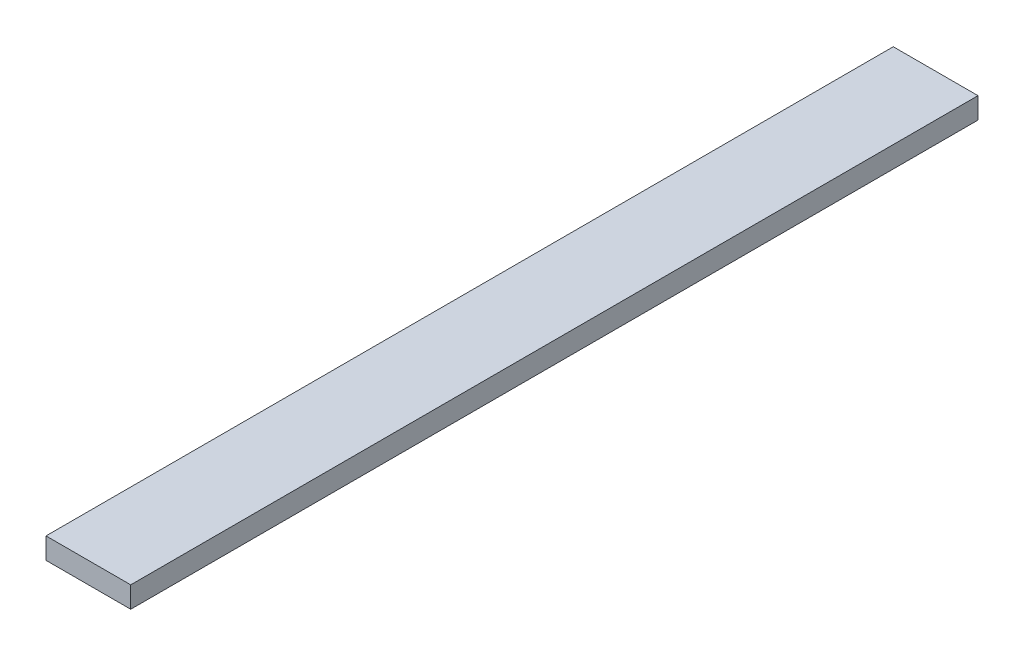
ISO-10303-21;
HEADER;
FILE_DESCRIPTION(('STEP AP214'),'2;1');
FILE_NAME('part.step','',(''),(''),'','','');
FILE_SCHEMA(('AUTOMOTIVE_DESIGN { 1 0 10303 214 1 1 1 1 }'));
ENDSEC;
DATA;
#1=APPLICATION_CONTEXT('core data for automotive mechanical design processes');
#2=APPLICATION_PROTOCOL_DEFINITION('international standard','automotive_design',2000,#1);
#3=PRODUCT_CONTEXT('',#1,'mechanical');
#4=PRODUCT('Part','Part','',(#3));
#5=PRODUCT_RELATED_PRODUCT_CATEGORY('part','',(#4));
#6=PRODUCT_DEFINITION_FORMATION('','',#4);
#7=PRODUCT_DEFINITION_CONTEXT('part definition',#1,'design');
#8=PRODUCT_DEFINITION('design','',#6,#7);
#9=PRODUCT_DEFINITION_SHAPE('','',#8);
#10=(LENGTH_UNIT() NAMED_UNIT(*) SI_UNIT(.MILLI.,.METRE.));
#11=(NAMED_UNIT(*) PLANE_ANGLE_UNIT() SI_UNIT($,.RADIAN.));
#12=(NAMED_UNIT(*) SI_UNIT($,.STERADIAN.) SOLID_ANGLE_UNIT());
#13=UNCERTAINTY_MEASURE_WITH_UNIT(LENGTH_MEASURE(1.E-05),#10,'distance_accuracy_value','');
#14=(GEOMETRIC_REPRESENTATION_CONTEXT(3) GLOBAL_UNCERTAINTY_ASSIGNED_CONTEXT((#13)) GLOBAL_UNIT_ASSIGNED_CONTEXT((#10,
#11,#12)) REPRESENTATION_CONTEXT('',''));
#15=CARTESIAN_POINT('',(0.,0.,0.));
#16=DIRECTION('',(0.,0.,1.));
#17=DIRECTION('',(1.,0.,0.));
#18=AXIS2_PLACEMENT_3D('',#15,#16,#17);
#19=CARTESIAN_POINT('',(3.,1.5,30.));
#20=DIRECTION('',(-1.,0.,0.));
#21=DIRECTION('',(0.,0.,1.));
#22=AXIS2_PLACEMENT_3D('',#19,#20,#21);
#23=PLANE('',#22);
#24=DIRECTION('',(0.,0.,-1.));
#25=VECTOR('',#24,1.);
#26=CARTESIAN_POINT('',(3.,0.,30.));
#27=LINE('',#26,#25);
#28=CARTESIAN_POINT('',(3.,0.,30.));
#29=VERTEX_POINT('',#28);
#30=CARTESIAN_POINT('',(3.,0.,-30.));
#31=VERTEX_POINT('',#30);
#32=EDGE_CURVE('E112',#29,#31,#27,.T.);
#33=ORIENTED_EDGE('',*,*,#32,.T.);
#34=DIRECTION('',(0.,-1.,0.));
#35=VECTOR('',#34,1.);
#36=CARTESIAN_POINT('',(3.,1.5,-30.));
#37=LINE('',#36,#35);
#38=CARTESIAN_POINT('',(3.,1.5,-30.));
#39=VERTEX_POINT('',#38);
#40=EDGE_CURVE('E11',#39,#31,#37,.T.);
#41=ORIENTED_EDGE('',*,*,#40,.F.);
#42=DIRECTION('',(0.,0.,-1.));
#43=VECTOR('',#42,1.);
#44=CARTESIAN_POINT('',(3.,1.5,30.));
#45=LINE('',#44,#43);
#46=CARTESIAN_POINT('',(3.,1.5,30.));
#47=VERTEX_POINT('',#46);
#48=EDGE_CURVE('E100',#47,#39,#45,.T.);
#49=ORIENTED_EDGE('',*,*,#48,.F.);
#50=DIRECTION('',(0.,-1.,0.));
#51=VECTOR('',#50,1.);
#52=CARTESIAN_POINT('',(3.,1.5,30.));
#53=LINE('',#52,#51);
#54=EDGE_CURVE('E108',#47,#29,#53,.T.);
#55=ORIENTED_EDGE('',*,*,#54,.T.);
#56=EDGE_LOOP('',(#33,#41,#49,#55));
#57=FACE_BOUND('',#56,.T.);
#58=ADVANCED_FACE('F49',(#57),#23,.F.);
#59=CARTESIAN_POINT('',(-3.,1.5,-30.));
#60=DIRECTION('',(0.,0.,1.));
#61=DIRECTION('',(1.,0.,0.));
#62=AXIS2_PLACEMENT_3D('',#59,#60,#61);
#63=PLANE('',#62);
#64=DIRECTION('',(-1.,0.,0.));
#65=VECTOR('',#64,1.);
#66=CARTESIAN_POINT('',(-3.,0.,-30.));
#67=LINE('',#66,#65);
#68=CARTESIAN_POINT('',(-3.,0.,-30.));
#69=VERTEX_POINT('',#68);
#70=EDGE_CURVE('E104',#31,#69,#67,.T.);
#71=ORIENTED_EDGE('',*,*,#70,.T.);
#72=DIRECTION('',(0.,-1.,0.));
#73=VECTOR('',#72,1.);
#74=CARTESIAN_POINT('',(-3.,1.5,-30.));
#75=LINE('',#74,#73);
#76=CARTESIAN_POINT('',(-3.,1.5,-30.));
#77=VERTEX_POINT('',#76);
#78=EDGE_CURVE('E57',#77,#69,#75,.T.);
#79=ORIENTED_EDGE('',*,*,#78,.F.);
#80=DIRECTION('',(-1.,0.,0.));
#81=VECTOR('',#80,1.);
#82=CARTESIAN_POINT('',(-3.,1.5,-30.));
#83=LINE('',#82,#81);
#84=EDGE_CURVE('E95',#39,#77,#83,.T.);
#85=ORIENTED_EDGE('',*,*,#84,.F.);
#86=ORIENTED_EDGE('',*,*,#40,.T.);
#87=EDGE_LOOP('',(#71,#79,#85,#86));
#88=FACE_BOUND('',#87,.T.);
#89=ADVANCED_FACE('F103',(#88),#63,.F.);
#90=CARTESIAN_POINT('',(-3.,1.5,30.));
#91=DIRECTION('',(1.,0.,0.));
#92=DIRECTION('',(0.,0.,-1.));
#93=AXIS2_PLACEMENT_3D('',#90,#91,#92);
#94=PLANE('',#93);
#95=DIRECTION('',(0.,0.,1.));
#96=VECTOR('',#95,1.);
#97=CARTESIAN_POINT('',(-3.,0.,30.));
#98=LINE('',#97,#96);
#99=CARTESIAN_POINT('',(-3.,0.,30.));
#100=VERTEX_POINT('',#99);
#101=EDGE_CURVE('E82',#69,#100,#98,.T.);
#102=ORIENTED_EDGE('',*,*,#101,.T.);
#103=DIRECTION('',(0.,-1.,0.));
#104=VECTOR('',#103,1.);
#105=CARTESIAN_POINT('',(-3.,1.5,30.));
#106=LINE('',#105,#104);
#107=CARTESIAN_POINT('',(-3.,1.5,30.));
#108=VERTEX_POINT('',#107);
#109=EDGE_CURVE('E105',#108,#100,#106,.T.);
#110=ORIENTED_EDGE('',*,*,#109,.F.);
#111=DIRECTION('',(0.,0.,1.));
#112=VECTOR('',#111,1.);
#113=CARTESIAN_POINT('',(-3.,1.5,30.));
#114=LINE('',#113,#112);
#115=EDGE_CURVE('E98',#77,#108,#114,.T.);
#116=ORIENTED_EDGE('',*,*,#115,.F.);
#117=ORIENTED_EDGE('',*,*,#78,.T.);
#118=EDGE_LOOP('',(#102,#110,#116,#117));
#119=FACE_BOUND('',#118,.T.);
#120=ADVANCED_FACE('F106',(#119),#94,.F.);
#121=CARTESIAN_POINT('',(-3.,1.5,30.));
#122=DIRECTION('',(0.,0.,-1.));
#123=DIRECTION('',(-1.,0.,0.));
#124=AXIS2_PLACEMENT_3D('',#121,#122,#123);
#125=PLANE('',#124);
#126=DIRECTION('',(1.,0.,0.));
#127=VECTOR('',#126,1.);
#128=CARTESIAN_POINT('',(-3.,0.,30.));
#129=LINE('',#128,#127);
#130=EDGE_CURVE('E88',#100,#29,#129,.T.);
#131=ORIENTED_EDGE('',*,*,#130,.T.);
#132=ORIENTED_EDGE('',*,*,#54,.F.);
#133=DIRECTION('',(1.,0.,0.));
#134=VECTOR('',#133,1.);
#135=CARTESIAN_POINT('',(-3.,1.5,30.));
#136=LINE('',#135,#134);
#137=EDGE_CURVE('E65',#108,#47,#136,.T.);
#138=ORIENTED_EDGE('',*,*,#137,.F.);
#139=ORIENTED_EDGE('',*,*,#109,.T.);
#140=EDGE_LOOP('',(#131,#132,#138,#139));
#141=FACE_BOUND('',#140,.T.);
#142=ADVANCED_FACE('F119',(#141),#125,.F.);
#143=CARTESIAN_POINT('',(0.,1.5,0.));
#144=DIRECTION('',(0.,-1.,0.));
#145=DIRECTION('',(0.,0.,-1.));
#146=AXIS2_PLACEMENT_3D('',#143,#144,#145);
#147=PLANE('',#146);
#148=ORIENTED_EDGE('',*,*,#48,.T.);
#149=ORIENTED_EDGE('',*,*,#84,.T.);
#150=ORIENTED_EDGE('',*,*,#115,.T.);
#151=ORIENTED_EDGE('',*,*,#137,.T.);
#152=EDGE_LOOP('',(#148,#149,#150,#151));
#153=FACE_BOUND('',#152,.T.);
#154=ADVANCED_FACE('F96',(#153),#147,.F.);
#155=CARTESIAN_POINT('',(0.,0.,0.));
#156=DIRECTION('',(0.,-1.,0.));
#157=DIRECTION('',(0.,0.,-1.));
#158=AXIS2_PLACEMENT_3D('',#155,#156,#157);
#159=PLANE('',#158);
#160=ORIENTED_EDGE('',*,*,#32,.F.);
#161=ORIENTED_EDGE('',*,*,#130,.F.);
#162=ORIENTED_EDGE('',*,*,#101,.F.);
#163=ORIENTED_EDGE('',*,*,#70,.F.);
#164=EDGE_LOOP('',(#160,#161,#162,#163));
#165=FACE_BOUND('',#164,.T.);
#166=ADVANCED_FACE('F122',(#165),#159,.T.);
#167=CLOSED_SHELL('',(#58,#89,#120,#142,#154,#166));
#168=MANIFOLD_SOLID_BREP('B2',#167);
#169=ADVANCED_BREP_SHAPE_REPRESENTATION('',(#18,#168),#14);
#170=SHAPE_DEFINITION_REPRESENTATION(#9,#169);
ENDSEC;
END-ISO-10303-21;
